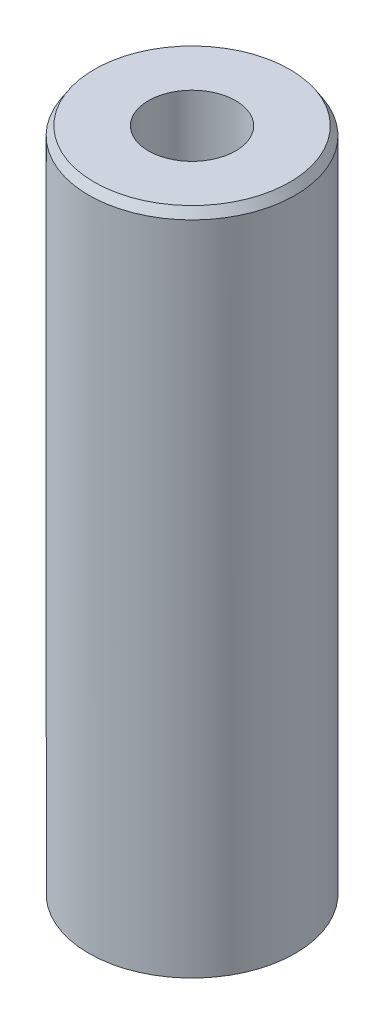
ISO-10303-21;
HEADER;
FILE_DESCRIPTION(('STEP AP214'),'2;1');
FILE_NAME('part.step','',(''),(''),'','','');
FILE_SCHEMA(('AUTOMOTIVE_DESIGN { 1 0 10303 214 1 1 1 1 }'));
ENDSEC;
DATA;
#1=APPLICATION_CONTEXT('core data for automotive mechanical design processes');
#2=APPLICATION_PROTOCOL_DEFINITION('international standard','automotive_design',2000,#1);
#3=PRODUCT_CONTEXT('',#1,'mechanical');
#4=PRODUCT('Part','Part','',(#3));
#5=PRODUCT_RELATED_PRODUCT_CATEGORY('part','',(#4));
#6=PRODUCT_DEFINITION_FORMATION('','',#4);
#7=PRODUCT_DEFINITION_CONTEXT('part definition',#1,'design');
#8=PRODUCT_DEFINITION('design','',#6,#7);
#9=PRODUCT_DEFINITION_SHAPE('','',#8);
#10=(LENGTH_UNIT() NAMED_UNIT(*) SI_UNIT(.MILLI.,.METRE.));
#11=(NAMED_UNIT(*) PLANE_ANGLE_UNIT() SI_UNIT($,.RADIAN.));
#12=(NAMED_UNIT(*) SI_UNIT($,.STERADIAN.) SOLID_ANGLE_UNIT());
#13=UNCERTAINTY_MEASURE_WITH_UNIT(LENGTH_MEASURE(1.E-05),#10,'distance_accuracy_value','');
#14=(GEOMETRIC_REPRESENTATION_CONTEXT(3) GLOBAL_UNCERTAINTY_ASSIGNED_CONTEXT((#13)) GLOBAL_UNIT_ASSIGNED_CONTEXT((#10,
#11,#12)) REPRESENTATION_CONTEXT('',''));
#15=CARTESIAN_POINT('',(0.,0.,0.));
#16=DIRECTION('',(0.,0.,1.));
#17=DIRECTION('',(1.,0.,0.));
#18=AXIS2_PLACEMENT_3D('',#15,#16,#17);
#19=CARTESIAN_POINT('',(0.,48.7328527615144,0.));
#20=DIRECTION('',(0.,-1.,0.));
#21=DIRECTION('',(0.,0.,-1.));
#22=AXIS2_PLACEMENT_3D('',#19,#20,#21);
#23=CYLINDRICAL_SURFACE('',#22,7.5);
#24=CARTESIAN_POINT('',(0.,48.108871674699,0.));
#25=DIRECTION('',(0.,1.,0.));
#26=DIRECTION('',(0.,0.,1.));
#27=AXIS2_PLACEMENT_3D('',#24,#25,#26);
#28=CIRCLE('',#27,7.5);
#29=CARTESIAN_POINT('',(0.,48.108871674699,-7.5));
#30=VERTEX_POINT('',#29);
#31=EDGE_CURVE('E50',#30,#30,#28,.F.);
#32=ORIENTED_EDGE('',*,*,#31,.T.);
#33=EDGE_LOOP('',(#32));
#34=FACE_BOUND('',#33,.T.);
#35=CARTESIAN_POINT('',(0.,0.397410260045805,0.));
#36=DIRECTION('',(0.,1.,0.));
#37=DIRECTION('',(0.,0.,1.));
#38=AXIS2_PLACEMENT_3D('',#35,#36,#37);
#39=CIRCLE('',#38,7.5);
#40=CARTESIAN_POINT('',(0.,0.397410260045805,7.5));
#41=VERTEX_POINT('',#40);
#42=EDGE_CURVE('E51',#41,#41,#39,.T.);
#43=ORIENTED_EDGE('',*,*,#42,.T.);
#44=EDGE_LOOP('',(#43));
#45=FACE_BOUND('',#44,.T.);
#46=ADVANCED_FACE('F39',(#34,#45),#23,.T.);
#47=CARTESIAN_POINT('',(0.,48.7328527615144,0.));
#48=DIRECTION('',(0.,1.,0.));
#49=DIRECTION('',(0.,0.,1.));
#50=AXIS2_PLACEMENT_3D('',#47,#48,#49);
#51=PLANE('',#50);
#52=CARTESIAN_POINT('',(0.,48.7328527615144,0.));
#53=DIRECTION('',(0.,1.,0.));
#54=DIRECTION('',(0.,0.,1.));
#55=AXIS2_PLACEMENT_3D('',#52,#53,#54);
#56=CIRCLE('',#55,7.10258973995419);
#57=CARTESIAN_POINT('',(0.,48.7328527615144,-7.10258973995419));
#58=VERTEX_POINT('',#57);
#59=EDGE_CURVE('E54',#58,#58,#56,.T.);
#60=ORIENTED_EDGE('',*,*,#59,.T.);
#61=EDGE_LOOP('',(#60));
#62=FACE_BOUND('',#61,.T.);
#63=CARTESIAN_POINT('',(0.,48.7328527615144,0.));
#64=DIRECTION('',(0.,1.,0.));
#65=DIRECTION('',(0.,0.,1.));
#66=AXIS2_PLACEMENT_3D('',#63,#64,#65);
#67=CIRCLE('',#66,3.16922035868216);
#68=CARTESIAN_POINT('',(0.,48.7328527615144,3.16922035868216));
#69=VERTEX_POINT('',#68);
#70=EDGE_CURVE('E58',#69,#69,#67,.T.);
#71=ORIENTED_EDGE('',*,*,#70,.F.);
#72=EDGE_LOOP('',(#71));
#73=FACE_BOUND('',#72,.T.);
#74=ADVANCED_FACE('F69',(#62,#73),#51,.T.);
#75=CARTESIAN_POINT('',(0.,0.,0.));
#76=DIRECTION('',(0.,1.,0.));
#77=DIRECTION('',(0.,0.,1.));
#78=AXIS2_PLACEMENT_3D('',#75,#76,#77);
#79=PLANE('',#78);
#80=CARTESIAN_POINT('',(0.,0.,0.));
#81=DIRECTION('',(0.,1.,0.));
#82=DIRECTION('',(0.,0.,1.));
#83=AXIS2_PLACEMENT_3D('',#80,#81,#82);
#84=CIRCLE('',#83,6.8760189131846);
#85=CARTESIAN_POINT('',(0.,0.,6.8760189131846));
#86=VERTEX_POINT('',#85);
#87=EDGE_CURVE('E10',#86,#86,#84,.F.);
#88=ORIENTED_EDGE('',*,*,#87,.T.);
#89=EDGE_LOOP('',(#88));
#90=FACE_BOUND('',#89,.T.);
#91=CARTESIAN_POINT('',(0.,0.,0.));
#92=DIRECTION('',(0.,1.,0.));
#93=DIRECTION('',(0.,0.,1.));
#94=AXIS2_PLACEMENT_3D('',#91,#92,#93);
#95=CIRCLE('',#94,3.16922035868216);
#96=CARTESIAN_POINT('',(0.,0.,3.16922035868216));
#97=VERTEX_POINT('',#96);
#98=EDGE_CURVE('E63',#97,#97,#95,.T.);
#99=ORIENTED_EDGE('',*,*,#98,.T.);
#100=EDGE_LOOP('',(#99));
#101=FACE_BOUND('',#100,.T.);
#102=ADVANCED_FACE('F75',(#90,#101),#79,.F.);
#103=CARTESIAN_POINT('',(0.,48.7328527615144,0.));
#104=DIRECTION('',(0.,-1.,0.));
#105=DIRECTION('',(0.,0.,-1.));
#106=AXIS2_PLACEMENT_3D('',#103,#104,#105);
#107=CYLINDRICAL_SURFACE('',#106,3.16922035868216);
#108=ORIENTED_EDGE('',*,*,#70,.T.);
#109=EDGE_LOOP('',(#108));
#110=FACE_BOUND('',#109,.T.);
#111=ORIENTED_EDGE('',*,*,#98,.F.);
#112=EDGE_LOOP('',(#111));
#113=FACE_BOUND('',#112,.T.);
#114=ADVANCED_FACE('F70',(#110,#113),#107,.F.);
#115=CARTESIAN_POINT('',(0.,48.7328527615144,0.));
#116=DIRECTION('',(0.,-1.,0.));
#117=DIRECTION('',(0.,0.,-1.));
#118=AXIS2_PLACEMENT_3D('',#115,#116,#117);
#119=CONICAL_SURFACE('',#118,7.10258973995419,0.567107133725801);
#120=CARTESIAN_POINT('',(0.,48.108871674699,-7.5));
#121=CARTESIAN_POINT('',(0.,48.1153714776866,-7.49586030979119));
#122=CARTESIAN_POINT('',(0.,48.1218712806743,-7.49172061958238));
#123=CARTESIAN_POINT('',(0.,48.1348708866496,-7.48344123916476));
#124=CARTESIAN_POINT('',(0.,48.1413706896373,-7.47930154895595));
#125=CARTESIAN_POINT('',(0.,48.1543702956126,-7.47102216853833));
#126=CARTESIAN_POINT('',(0.,48.1608700986002,-7.46688247832952));
#127=CARTESIAN_POINT('',(0.,48.1738697045756,-7.4586030979119));
#128=CARTESIAN_POINT('',(0.,48.1803695075632,-7.45446340770309));
#129=CARTESIAN_POINT('',(0.,48.1933691135385,-7.44618402728547));
#130=CARTESIAN_POINT('',(0.,48.1998689165262,-7.44204433707665));
#131=CARTESIAN_POINT('',(0.,48.2128685225015,-7.43376495665903));
#132=CARTESIAN_POINT('',(0.,48.2193683254892,-7.42962526645022));
#133=CARTESIAN_POINT('',(0.,48.2323679314645,-7.4213458860326));
#134=CARTESIAN_POINT('',(0.,48.2388677344522,-7.41720619582379));
#135=CARTESIAN_POINT('',(0.,48.2518673404275,-7.40892681540617));
#136=CARTESIAN_POINT('',(0.,48.2583671434151,-7.40478712519736));
#137=CARTESIAN_POINT('',(0.,48.2713667493905,-7.39650774477974));
#138=CARTESIAN_POINT('',(0.,48.2778665523781,-7.39236805457093));
#139=CARTESIAN_POINT('',(0.,48.2908661583534,-7.38408867415331));
#140=CARTESIAN_POINT('',(0.,48.2973659613411,-7.3799489839445));
#141=CARTESIAN_POINT('',(0.,48.3103655673164,-7.37166960352688));
#142=CARTESIAN_POINT('',(0.,48.3168653703041,-7.36752991331807));
#143=CARTESIAN_POINT('',(0.,48.3298649762794,-7.35925053290044));
#144=CARTESIAN_POINT('',(0.,48.3363647792671,-7.35511084269163));
#145=CARTESIAN_POINT('',(0.,48.3493643852424,-7.34683146227401));
#146=CARTESIAN_POINT('',(0.,48.35586418823,-7.3426917720652));
#147=CARTESIAN_POINT('',(0.,48.3688637942054,-7.33441239164758));
#148=CARTESIAN_POINT('',(0.,48.375363597193,-7.33027270143877));
#149=CARTESIAN_POINT('',(0.,48.3883632031683,-7.32199332102115));
#150=CARTESIAN_POINT('',(0.,48.394863006156,-7.31785363081234));
#151=CARTESIAN_POINT('',(0.,48.4078626121313,-7.30957425039472));
#152=CARTESIAN_POINT('',(0.,48.414362415119,-7.30543456018591));
#153=CARTESIAN_POINT('',(0.,48.4273620210943,-7.29715517976829));
#154=CARTESIAN_POINT('',(0.,48.433861824082,-7.29301548955948));
#155=CARTESIAN_POINT('',(0.,48.4468614300573,-7.28473610914186));
#156=CARTESIAN_POINT('',(0.,48.453361233045,-7.28059641893304));
#157=CARTESIAN_POINT('',(0.,48.4663608390203,-7.27231703851542));
#158=CARTESIAN_POINT('',(0.,48.4728606420079,-7.26817734830661));
#159=CARTESIAN_POINT('',(0.,48.4858602479833,-7.25989796788899));
#160=CARTESIAN_POINT('',(0.,48.4923600509709,-7.25575827768018));
#161=CARTESIAN_POINT('',(0.,48.5053596569462,-7.24747889726256));
#162=CARTESIAN_POINT('',(0.,48.5118594599339,-7.24333920705375));
#163=CARTESIAN_POINT('',(0.,48.5248590659092,-7.23505982663613));
#164=CARTESIAN_POINT('',(0.,48.5313588688969,-7.23092013642732));
#165=CARTESIAN_POINT('',(0.,48.5443584748722,-7.2226407560097));
#166=CARTESIAN_POINT('',(0.,48.5508582778599,-7.21850106580089));
#167=CARTESIAN_POINT('',(0.,48.5638578838352,-7.21022168538327));
#168=CARTESIAN_POINT('',(0.,48.5703576868228,-7.20608199517446));
#169=CARTESIAN_POINT('',(0.,48.5833572927982,-7.19780261475684));
#170=CARTESIAN_POINT('',(0.,48.5898570957858,-7.19366292454802));
#171=CARTESIAN_POINT('',(0.,48.6028567017611,-7.1853835441304));
#172=CARTESIAN_POINT('',(0.,48.6093565047488,-7.18124385392159));
#173=CARTESIAN_POINT('',(0.,48.6223561107241,-7.17296447350397));
#174=CARTESIAN_POINT('',(0.,48.6288559137118,-7.16882478329516));
#175=CARTESIAN_POINT('',(0.,48.6418555196871,-7.16054540287754));
#176=CARTESIAN_POINT('',(0.,48.6483553226748,-7.15640571266873));
#177=CARTESIAN_POINT('',(0.,48.6613549286501,-7.14812633225111));
#178=CARTESIAN_POINT('',(0.,48.6678547316377,-7.1439866420423));
#179=CARTESIAN_POINT('',(0.,48.6808543376131,-7.13570726162468));
#180=CARTESIAN_POINT('',(0.,48.6873541406007,-7.13156757141587));
#181=CARTESIAN_POINT('',(0.,48.700353746576,-7.12328819099825));
#182=CARTESIAN_POINT('',(0.,48.7068535495637,-7.11914850078944));
#183=CARTESIAN_POINT('',(0.,48.719853155539,-7.11086912037181));
#184=CARTESIAN_POINT('',(0.,48.7263529585267,-7.106729430163));
#185=CARTESIAN_POINT('',(0.,48.7328527615144,-7.10258973995419));
#186=B_SPLINE_CURVE_WITH_KNOTS('',3,(#120,#121,#122,#123,#124,#125,#126,#127,#128,#129,#130,
#131,#132,#133,#134,#135,#136,#137,#138,#139,#140,#141,#142,#143,#144,#145,#146,#147,#148,#149,
#150,#151,#152,#153,#154,#155,#156,#157,#158,#159,#160,#161,#162,#163,#164,#165,#166,#167,#168,
#169,#170,#171,#172,#173,#174,#175,#176,#177,#178,#179,#180,#181,#182,#183,#184,#185),
.UNSPECIFIED.,.F.,.F.,(4,2,2,2,2,2,2,2,2,2,2,2,2,2,2,2,2,2,2,2,2,2,2,2,2,2,2,2,2,2,2,2,4),(0.,
0.0231183966816444,0.0462367933632887,0.0693551900449331,0.0924735867265775,0.115591983408222,
0.138710380089866,0.161828776771511,0.184947173453155,0.2080655701348,0.231183966816444,
0.254302363498089,0.277420760179733,0.300539156861377,0.323657553543022,0.346775950224666,
0.369894346906316,0.393012743587961,0.416131140269605,0.43924953695125,0.462367933632894,
0.485486330314539,0.508604726996183,0.531723123677827,0.554841520359472,0.577959917041116,
0.601078313722761,0.624196710404405,0.64731510708605,0.670433503767694,0.693551900449338,
0.716670297130983,0.739788693812633),.UNSPECIFIED.);
#187=EDGE_CURVE('BSEAM81',#30,#58,#186,.T.);
#188=ORIENTED_EDGE('',*,*,#31,.F.);
#189=ORIENTED_EDGE('',*,*,#59,.F.);
#190=ORIENTED_EDGE('',*,*,#187,.T.);
#191=ORIENTED_EDGE('',*,*,#187,.F.);
#192=EDGE_LOOP('',(#188,#190,#189,#191));
#193=FACE_BOUND('',#192,.T.);
#194=ADVANCED_FACE('F81',(#193),#119,.T.);
#195=CARTESIAN_POINT('',(0.,0.397410260045805,0.));
#196=DIRECTION('',(0.,1.,0.));
#197=DIRECTION('',(0.,0.,1.));
#198=AXIS2_PLACEMENT_3D('',#195,#196,#197);
#199=CONICAL_SURFACE('',#198,7.5,1.0036891930691);
#200=ORIENTED_EDGE('',*,*,#87,.F.);
#201=EDGE_LOOP('',(#200));
#202=FACE_BOUND('',#201,.T.);
#203=ORIENTED_EDGE('',*,*,#42,.F.);
#204=EDGE_LOOP('',(#203));
#205=FACE_BOUND('',#204,.T.);
#206=ADVANCED_FACE('F45',(#202,#205),#199,.T.);
#207=CLOSED_SHELL('',(#46,#74,#102,#114,#194,#206));
#208=MANIFOLD_SOLID_BREP('B2',#207);
#209=ADVANCED_BREP_SHAPE_REPRESENTATION('',(#18,#208),#14);
#210=SHAPE_DEFINITION_REPRESENTATION(#9,#209);
ENDSEC;
END-ISO-10303-21;
